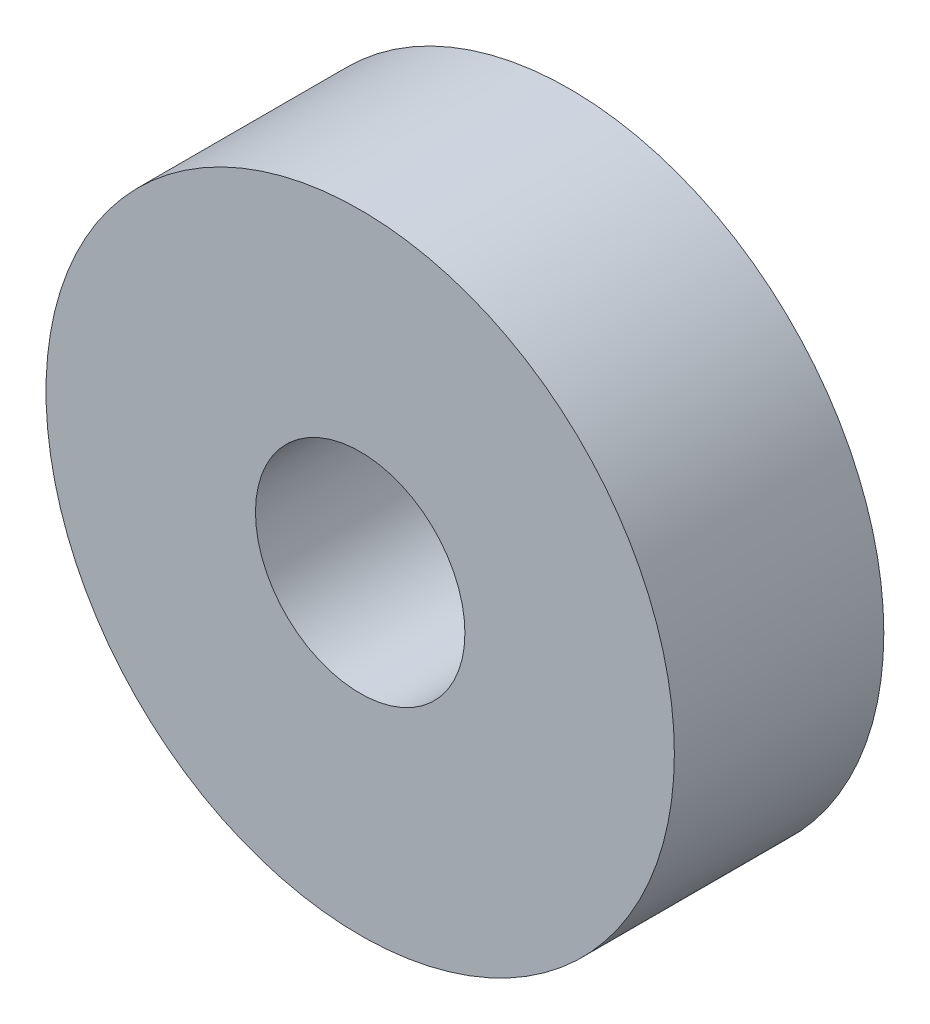
ISO-10303-21;
HEADER;
FILE_DESCRIPTION(('STEP AP214'),'2;1');
FILE_NAME('part.step','',(''),(''),'','','');
FILE_SCHEMA(('AUTOMOTIVE_DESIGN { 1 0 10303 214 1 1 1 1 }'));
ENDSEC;
DATA;
#1=APPLICATION_CONTEXT('core data for automotive mechanical design processes');
#2=APPLICATION_PROTOCOL_DEFINITION('international standard','automotive_design',2000,#1);
#3=PRODUCT_CONTEXT('',#1,'mechanical');
#4=PRODUCT('Part','Part','',(#3));
#5=PRODUCT_RELATED_PRODUCT_CATEGORY('part','',(#4));
#6=PRODUCT_DEFINITION_FORMATION('','',#4);
#7=PRODUCT_DEFINITION_CONTEXT('part definition',#1,'design');
#8=PRODUCT_DEFINITION('design','',#6,#7);
#9=PRODUCT_DEFINITION_SHAPE('','',#8);
#10=(LENGTH_UNIT() NAMED_UNIT(*) SI_UNIT(.MILLI.,.METRE.));
#11=(NAMED_UNIT(*) PLANE_ANGLE_UNIT() SI_UNIT($,.RADIAN.));
#12=(NAMED_UNIT(*) SI_UNIT($,.STERADIAN.) SOLID_ANGLE_UNIT());
#13=UNCERTAINTY_MEASURE_WITH_UNIT(LENGTH_MEASURE(1.E-05),#10,'distance_accuracy_value','');
#14=(GEOMETRIC_REPRESENTATION_CONTEXT(3) GLOBAL_UNCERTAINTY_ASSIGNED_CONTEXT((#13)) GLOBAL_UNIT_ASSIGNED_CONTEXT((#10,
#11,#12)) REPRESENTATION_CONTEXT('',''));
#15=CARTESIAN_POINT('',(0.,0.,0.));
#16=DIRECTION('',(0.,0.,1.));
#17=DIRECTION('',(1.,0.,0.));
#18=AXIS2_PLACEMENT_3D('',#15,#16,#17);
#19=CARTESIAN_POINT('',(0.,0.,4.75));
#20=DIRECTION('',(0.,0.,1.));
#21=DIRECTION('',(1.,0.,0.));
#22=AXIS2_PLACEMENT_3D('',#19,#20,#21);
#23=PLANE('',#22);
#24=CARTESIAN_POINT('',(0.,0.,4.75));
#25=DIRECTION('',(0.,0.,1.));
#26=DIRECTION('',(1.,0.,0.));
#27=AXIS2_PLACEMENT_3D('',#24,#25,#26);
#28=CIRCLE('',#27,14.25);
#29=CARTESIAN_POINT('',(14.25,0.,4.75));
#30=VERTEX_POINT('',#29);
#31=EDGE_CURVE('E10',#30,#30,#28,.T.);
#32=ORIENTED_EDGE('',*,*,#31,.T.);
#33=EDGE_LOOP('',(#32));
#34=FACE_BOUND('',#33,.T.);
#35=CARTESIAN_POINT('',(0.,0.,4.75));
#36=DIRECTION('',(0.,0.,1.));
#37=DIRECTION('',(1.,0.,0.));
#38=AXIS2_PLACEMENT_3D('',#35,#36,#37);
#39=CIRCLE('',#38,4.75);
#40=CARTESIAN_POINT('',(4.75,0.,4.75));
#41=VERTEX_POINT('',#40);
#42=EDGE_CURVE('E41',#41,#41,#39,.T.);
#43=ORIENTED_EDGE('',*,*,#42,.F.);
#44=EDGE_LOOP('',(#43));
#45=FACE_BOUND('',#44,.T.);
#46=ADVANCED_FACE('F30',(#34,#45),#23,.T.);
#47=CARTESIAN_POINT('',(0.,0.,-4.75));
#48=DIRECTION('',(0.,0.,1.));
#49=DIRECTION('',(1.,0.,0.));
#50=AXIS2_PLACEMENT_3D('',#47,#48,#49);
#51=PLANE('',#50);
#52=CARTESIAN_POINT('',(0.,0.,-4.75));
#53=DIRECTION('',(0.,0.,1.));
#54=DIRECTION('',(1.,0.,0.));
#55=AXIS2_PLACEMENT_3D('',#52,#53,#54);
#56=CIRCLE('',#55,14.25);
#57=CARTESIAN_POINT('',(14.25,0.,-4.75));
#58=VERTEX_POINT('',#57);
#59=EDGE_CURVE('E34',#58,#58,#56,.T.);
#60=ORIENTED_EDGE('',*,*,#59,.F.);
#61=EDGE_LOOP('',(#60));
#62=FACE_BOUND('',#61,.T.);
#63=CARTESIAN_POINT('',(0.,0.,-4.75));
#64=DIRECTION('',(0.,0.,1.));
#65=DIRECTION('',(1.,0.,0.));
#66=AXIS2_PLACEMENT_3D('',#63,#64,#65);
#67=CIRCLE('',#66,4.75);
#68=CARTESIAN_POINT('',(4.75,0.,-4.75));
#69=VERTEX_POINT('',#68);
#70=EDGE_CURVE('E43',#69,#69,#67,.T.);
#71=ORIENTED_EDGE('',*,*,#70,.T.);
#72=EDGE_LOOP('',(#71));
#73=FACE_BOUND('',#72,.T.);
#74=ADVANCED_FACE('F53',(#62,#73),#51,.F.);
#75=CARTESIAN_POINT('',(0.,0.,4.75));
#76=DIRECTION('',(0.,0.,-1.));
#77=DIRECTION('',(-1.,0.,0.));
#78=AXIS2_PLACEMENT_3D('',#75,#76,#77);
#79=CYLINDRICAL_SURFACE('',#78,14.25);
#80=ORIENTED_EDGE('',*,*,#31,.F.);
#81=EDGE_LOOP('',(#80));
#82=FACE_BOUND('',#81,.T.);
#83=ORIENTED_EDGE('',*,*,#59,.T.);
#84=EDGE_LOOP('',(#83));
#85=FACE_BOUND('',#84,.T.);
#86=ADVANCED_FACE('F32',(#82,#85),#79,.T.);
#87=CARTESIAN_POINT('',(0.,0.,4.75));
#88=DIRECTION('',(0.,0.,-1.));
#89=DIRECTION('',(-1.,0.,0.));
#90=AXIS2_PLACEMENT_3D('',#87,#88,#89);
#91=CYLINDRICAL_SURFACE('',#90,4.75);
#92=ORIENTED_EDGE('',*,*,#42,.T.);
#93=EDGE_LOOP('',(#92));
#94=FACE_BOUND('',#93,.T.);
#95=ORIENTED_EDGE('',*,*,#70,.F.);
#96=EDGE_LOOP('',(#95));
#97=FACE_BOUND('',#96,.T.);
#98=ADVANCED_FACE('F49',(#94,#97),#91,.F.);
#99=CLOSED_SHELL('',(#46,#74,#86,#98));
#100=MANIFOLD_SOLID_BREP('B2',#99);
#101=ADVANCED_BREP_SHAPE_REPRESENTATION('',(#18,#100),#14);
#102=SHAPE_DEFINITION_REPRESENTATION(#9,#101);
ENDSEC;
END-ISO-10303-21;
